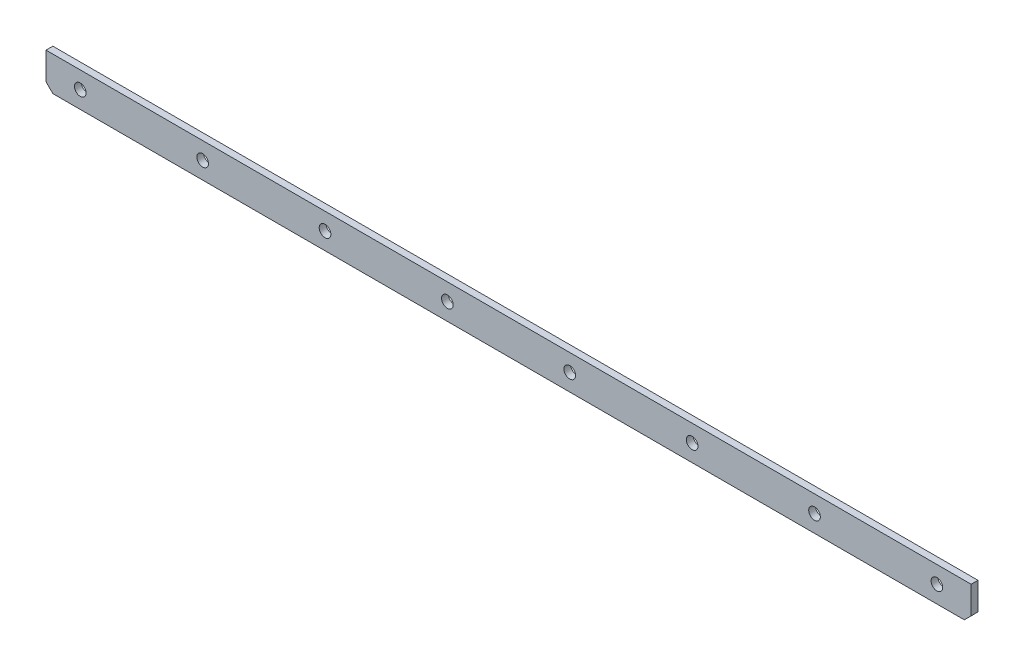
ISO-10303-21;
HEADER;
FILE_DESCRIPTION(('STEP AP214'),'2;1');
FILE_NAME('part.step','',(''),(''),'','','');
FILE_SCHEMA(('AUTOMOTIVE_DESIGN { 1 0 10303 214 1 1 1 1 }'));
ENDSEC;
DATA;
#1=APPLICATION_CONTEXT('core data for automotive mechanical design processes');
#2=APPLICATION_PROTOCOL_DEFINITION('international standard','automotive_design',2000,#1);
#3=PRODUCT_CONTEXT('',#1,'mechanical');
#4=PRODUCT('Part','Part','',(#3));
#5=PRODUCT_RELATED_PRODUCT_CATEGORY('part','',(#4));
#6=PRODUCT_DEFINITION_FORMATION('','',#4);
#7=PRODUCT_DEFINITION_CONTEXT('part definition',#1,'design');
#8=PRODUCT_DEFINITION('design','',#6,#7);
#9=PRODUCT_DEFINITION_SHAPE('','',#8);
#10=(LENGTH_UNIT() NAMED_UNIT(*) SI_UNIT(.MILLI.,.METRE.));
#11=(NAMED_UNIT(*) PLANE_ANGLE_UNIT() SI_UNIT($,.RADIAN.));
#12=(NAMED_UNIT(*) SI_UNIT($,.STERADIAN.) SOLID_ANGLE_UNIT());
#13=UNCERTAINTY_MEASURE_WITH_UNIT(LENGTH_MEASURE(1.E-05),#10,'distance_accuracy_value','');
#14=(GEOMETRIC_REPRESENTATION_CONTEXT(3) GLOBAL_UNCERTAINTY_ASSIGNED_CONTEXT((#13)) GLOBAL_UNIT_ASSIGNED_CONTEXT((#10,
#11,#12)) REPRESENTATION_CONTEXT('',''));
#15=CARTESIAN_POINT('',(0.,0.,0.));
#16=DIRECTION('',(0.,0.,1.));
#17=DIRECTION('',(1.,0.,0.));
#18=AXIS2_PLACEMENT_3D('',#15,#16,#17);
#19=CARTESIAN_POINT('',(-125.,0.,2.));
#20=DIRECTION('',(0.,0.,1.));
#21=DIRECTION('',(1.,0.,0.));
#22=AXIS2_PLACEMENT_3D('',#19,#20,#21);
#23=CYLINDRICAL_SURFACE('',#22,1.70000000000001);
#24=CARTESIAN_POINT('',(-125.,0.,0.));
#25=DIRECTION('',(0.,0.,1.));
#26=DIRECTION('',(1.,0.,0.));
#27=AXIS2_PLACEMENT_3D('',#24,#25,#26);
#28=CIRCLE('',#27,1.70000000000001);
#29=CARTESIAN_POINT('',(-123.3,0.,0.));
#30=VERTEX_POINT('',#29);
#31=EDGE_CURVE('E43',#30,#30,#28,.T.);
#32=ORIENTED_EDGE('',*,*,#31,.F.);
#33=EDGE_LOOP('',(#32));
#34=FACE_BOUND('',#33,.T.);
#35=CARTESIAN_POINT('',(-125.,0.,2.));
#36=DIRECTION('',(0.,0.,1.));
#37=DIRECTION('',(1.,0.,0.));
#38=AXIS2_PLACEMENT_3D('',#35,#36,#37);
#39=CIRCLE('',#38,1.70000000000001);
#40=CARTESIAN_POINT('',(-123.3,0.,2.));
#41=VERTEX_POINT('',#40);
#42=EDGE_CURVE('E11',#41,#41,#39,.T.);
#43=ORIENTED_EDGE('',*,*,#42,.T.);
#44=EDGE_LOOP('',(#43));
#45=FACE_BOUND('',#44,.T.);
#46=ADVANCED_FACE('F36',(#34,#45),#23,.F.);
#47=CARTESIAN_POINT('',(-89.2857142857143,0.,2.));
#48=DIRECTION('',(0.,0.,1.));
#49=DIRECTION('',(1.,0.,0.));
#50=AXIS2_PLACEMENT_3D('',#47,#48,#49);
#51=CYLINDRICAL_SURFACE('',#50,1.70000000000001);
#52=CARTESIAN_POINT('',(-89.2857142857143,0.,0.));
#53=DIRECTION('',(0.,0.,1.));
#54=DIRECTION('',(1.,0.,0.));
#55=AXIS2_PLACEMENT_3D('',#52,#53,#54);
#56=CIRCLE('',#55,1.70000000000001);
#57=CARTESIAN_POINT('',(-87.5857142857143,0.,0.));
#58=VERTEX_POINT('',#57);
#59=EDGE_CURVE('E164',#58,#58,#56,.T.);
#60=ORIENTED_EDGE('',*,*,#59,.F.);
#61=EDGE_LOOP('',(#60));
#62=FACE_BOUND('',#61,.T.);
#63=CARTESIAN_POINT('',(-89.2857142857143,0.,2.));
#64=DIRECTION('',(0.,0.,1.));
#65=DIRECTION('',(1.,0.,0.));
#66=AXIS2_PLACEMENT_3D('',#63,#64,#65);
#67=CIRCLE('',#66,1.70000000000001);
#68=CARTESIAN_POINT('',(-87.5857142857143,0.,2.));
#69=VERTEX_POINT('',#68);
#70=EDGE_CURVE('E167',#69,#69,#67,.T.);
#71=ORIENTED_EDGE('',*,*,#70,.T.);
#72=EDGE_LOOP('',(#71));
#73=FACE_BOUND('',#72,.T.);
#74=ADVANCED_FACE('F176',(#62,#73),#51,.F.);
#75=CARTESIAN_POINT('',(-53.5714285714286,0.,2.));
#76=DIRECTION('',(0.,0.,1.));
#77=DIRECTION('',(1.,0.,0.));
#78=AXIS2_PLACEMENT_3D('',#75,#76,#77);
#79=CYLINDRICAL_SURFACE('',#78,1.70000000000001);
#80=CARTESIAN_POINT('',(-53.5714285714286,0.,0.));
#81=DIRECTION('',(0.,0.,1.));
#82=DIRECTION('',(1.,0.,0.));
#83=AXIS2_PLACEMENT_3D('',#80,#81,#82);
#84=CIRCLE('',#83,1.70000000000001);
#85=CARTESIAN_POINT('',(-51.8714285714286,0.,0.));
#86=VERTEX_POINT('',#85);
#87=EDGE_CURVE('E158',#86,#86,#84,.T.);
#88=ORIENTED_EDGE('',*,*,#87,.F.);
#89=EDGE_LOOP('',(#88));
#90=FACE_BOUND('',#89,.T.);
#91=CARTESIAN_POINT('',(-53.5714285714286,0.,2.));
#92=DIRECTION('',(0.,0.,1.));
#93=DIRECTION('',(1.,0.,0.));
#94=AXIS2_PLACEMENT_3D('',#91,#92,#93);
#95=CIRCLE('',#94,1.70000000000001);
#96=CARTESIAN_POINT('',(-51.8714285714286,0.,2.));
#97=VERTEX_POINT('',#96);
#98=EDGE_CURVE('E161',#97,#97,#95,.T.);
#99=ORIENTED_EDGE('',*,*,#98,.T.);
#100=EDGE_LOOP('',(#99));
#101=FACE_BOUND('',#100,.T.);
#102=ADVANCED_FACE('F229',(#90,#101),#79,.F.);
#103=CARTESIAN_POINT('',(-17.8571428571429,0.,2.));
#104=DIRECTION('',(0.,0.,1.));
#105=DIRECTION('',(1.,0.,0.));
#106=AXIS2_PLACEMENT_3D('',#103,#104,#105);
#107=CYLINDRICAL_SURFACE('',#106,1.70000000000001);
#108=CARTESIAN_POINT('',(-17.8571428571429,0.,0.));
#109=DIRECTION('',(0.,0.,1.));
#110=DIRECTION('',(1.,0.,0.));
#111=AXIS2_PLACEMENT_3D('',#108,#109,#110);
#112=CIRCLE('',#111,1.70000000000001);
#113=CARTESIAN_POINT('',(-16.1571428571429,0.,0.));
#114=VERTEX_POINT('',#113);
#115=EDGE_CURVE('E152',#114,#114,#112,.T.);
#116=ORIENTED_EDGE('',*,*,#115,.F.);
#117=EDGE_LOOP('',(#116));
#118=FACE_BOUND('',#117,.T.);
#119=CARTESIAN_POINT('',(-17.8571428571429,0.,2.));
#120=DIRECTION('',(0.,0.,1.));
#121=DIRECTION('',(1.,0.,0.));
#122=AXIS2_PLACEMENT_3D('',#119,#120,#121);
#123=CIRCLE('',#122,1.70000000000001);
#124=CARTESIAN_POINT('',(-16.1571428571429,0.,2.));
#125=VERTEX_POINT('',#124);
#126=EDGE_CURVE('E155',#125,#125,#123,.T.);
#127=ORIENTED_EDGE('',*,*,#126,.T.);
#128=EDGE_LOOP('',(#127));
#129=FACE_BOUND('',#128,.T.);
#130=ADVANCED_FACE('F225',(#118,#129),#107,.F.);
#131=CARTESIAN_POINT('',(17.8571428571428,0.,2.));
#132=DIRECTION('',(0.,0.,1.));
#133=DIRECTION('',(1.,0.,0.));
#134=AXIS2_PLACEMENT_3D('',#131,#132,#133);
#135=CYLINDRICAL_SURFACE('',#134,1.70000000000001);
#136=CARTESIAN_POINT('',(17.8571428571428,0.,0.));
#137=DIRECTION('',(0.,0.,1.));
#138=DIRECTION('',(1.,0.,0.));
#139=AXIS2_PLACEMENT_3D('',#136,#137,#138);
#140=CIRCLE('',#139,1.70000000000001);
#141=CARTESIAN_POINT('',(19.5571428571428,0.,0.));
#142=VERTEX_POINT('',#141);
#143=EDGE_CURVE('E146',#142,#142,#140,.T.);
#144=ORIENTED_EDGE('',*,*,#143,.F.);
#145=EDGE_LOOP('',(#144));
#146=FACE_BOUND('',#145,.T.);
#147=CARTESIAN_POINT('',(17.8571428571428,0.,2.));
#148=DIRECTION('',(0.,0.,1.));
#149=DIRECTION('',(1.,0.,0.));
#150=AXIS2_PLACEMENT_3D('',#147,#148,#149);
#151=CIRCLE('',#150,1.70000000000001);
#152=CARTESIAN_POINT('',(19.5571428571428,0.,2.));
#153=VERTEX_POINT('',#152);
#154=EDGE_CURVE('E149',#153,#153,#151,.T.);
#155=ORIENTED_EDGE('',*,*,#154,.T.);
#156=EDGE_LOOP('',(#155));
#157=FACE_BOUND('',#156,.T.);
#158=ADVANCED_FACE('F221',(#146,#157),#135,.F.);
#159=CARTESIAN_POINT('',(53.5714285714285,0.,2.));
#160=DIRECTION('',(0.,0.,1.));
#161=DIRECTION('',(1.,0.,0.));
#162=AXIS2_PLACEMENT_3D('',#159,#160,#161);
#163=CYLINDRICAL_SURFACE('',#162,1.70000000000001);
#164=CARTESIAN_POINT('',(53.5714285714285,0.,0.));
#165=DIRECTION('',(0.,0.,1.));
#166=DIRECTION('',(1.,0.,0.));
#167=AXIS2_PLACEMENT_3D('',#164,#165,#166);
#168=CIRCLE('',#167,1.70000000000001);
#169=CARTESIAN_POINT('',(55.2714285714285,0.,0.));
#170=VERTEX_POINT('',#169);
#171=EDGE_CURVE('E140',#170,#170,#168,.T.);
#172=ORIENTED_EDGE('',*,*,#171,.F.);
#173=EDGE_LOOP('',(#172));
#174=FACE_BOUND('',#173,.T.);
#175=CARTESIAN_POINT('',(53.5714285714285,0.,2.));
#176=DIRECTION('',(0.,0.,1.));
#177=DIRECTION('',(1.,0.,0.));
#178=AXIS2_PLACEMENT_3D('',#175,#176,#177);
#179=CIRCLE('',#178,1.70000000000001);
#180=CARTESIAN_POINT('',(55.2714285714285,0.,2.));
#181=VERTEX_POINT('',#180);
#182=EDGE_CURVE('E143',#181,#181,#179,.T.);
#183=ORIENTED_EDGE('',*,*,#182,.T.);
#184=EDGE_LOOP('',(#183));
#185=FACE_BOUND('',#184,.T.);
#186=ADVANCED_FACE('F205',(#174,#185),#163,.F.);
#187=CARTESIAN_POINT('',(-135.,-5.00000000000002,2.));
#188=DIRECTION('',(1.,0.,0.));
#189=DIRECTION('',(0.,0.,-1.));
#190=AXIS2_PLACEMENT_3D('',#187,#188,#189);
#191=PLANE('',#190);
#192=DIRECTION('',(0.,-1.,0.));
#193=VECTOR('',#192,1.);
#194=CARTESIAN_POINT('',(-135.,-5.00000000000002,0.));
#195=LINE('',#194,#193);
#196=CARTESIAN_POINT('',(-135.,4.99999999999998,0.));
#197=VERTEX_POINT('',#196);
#198=CARTESIAN_POINT('',(-135.,-3.00000000000002,0.));
#199=VERTEX_POINT('',#198);
#200=EDGE_CURVE('E116',#197,#199,#195,.T.);
#201=ORIENTED_EDGE('',*,*,#200,.T.);
#202=DIRECTION('',(0.,0.,1.));
#203=VECTOR('',#202,1.);
#204=CARTESIAN_POINT('',(-135.,-3.00000000000002,2.));
#205=LINE('',#204,#203);
#206=CARTESIAN_POINT('',(-135.,-3.00000000000002,2.));
#207=VERTEX_POINT('',#206);
#208=EDGE_CURVE('E58',#199,#207,#205,.T.);
#209=ORIENTED_EDGE('',*,*,#208,.T.);
#210=DIRECTION('',(0.,-1.,0.));
#211=VECTOR('',#210,1.);
#212=CARTESIAN_POINT('',(-135.,-5.00000000000002,2.));
#213=LINE('',#212,#211);
#214=CARTESIAN_POINT('',(-135.,4.99999999999998,2.));
#215=VERTEX_POINT('',#214);
#216=EDGE_CURVE('E124',#215,#207,#213,.T.);
#217=ORIENTED_EDGE('',*,*,#216,.F.);
#218=DIRECTION('',(0.,0.,-1.));
#219=VECTOR('',#218,1.);
#220=CARTESIAN_POINT('',(-135.,4.99999999999998,2.));
#221=LINE('',#220,#219);
#222=EDGE_CURVE('E108',#215,#197,#221,.T.);
#223=ORIENTED_EDGE('',*,*,#222,.T.);
#224=EDGE_LOOP('',(#201,#209,#217,#223));
#225=FACE_BOUND('',#224,.T.);
#226=ADVANCED_FACE('F201',(#225),#191,.F.);
#227=CARTESIAN_POINT('',(135.,-4.99999999999998,2.));
#228=DIRECTION('',(0.,1.,0.));
#229=DIRECTION('',(-1.,0.,0.));
#230=AXIS2_PLACEMENT_3D('',#227,#228,#229);
#231=PLANE('',#230);
#232=DIRECTION('',(1.,0.,0.));
#233=VECTOR('',#232,1.);
#234=CARTESIAN_POINT('',(135.,-4.99999999999998,2.));
#235=LINE('',#234,#233);
#236=CARTESIAN_POINT('',(-133.,-5.00000000000002,2.));
#237=VERTEX_POINT('',#236);
#238=CARTESIAN_POINT('',(133.,-4.99999999999998,2.));
#239=VERTEX_POINT('',#238);
#240=EDGE_CURVE('E98',#237,#239,#235,.T.);
#241=ORIENTED_EDGE('',*,*,#240,.F.);
#242=DIRECTION('',(0.,0.,-1.));
#243=VECTOR('',#242,1.);
#244=CARTESIAN_POINT('',(-133.,-5.00000000000002,2.));
#245=LINE('',#244,#243);
#246=CARTESIAN_POINT('',(-133.,-5.00000000000002,0.));
#247=VERTEX_POINT('',#246);
#248=EDGE_CURVE('E127',#237,#247,#245,.T.);
#249=ORIENTED_EDGE('',*,*,#248,.T.);
#250=DIRECTION('',(1.,0.,0.));
#251=VECTOR('',#250,1.);
#252=CARTESIAN_POINT('',(135.,-4.99999999999998,0.));
#253=LINE('',#252,#251);
#254=CARTESIAN_POINT('',(133.,-4.99999999999998,0.));
#255=VERTEX_POINT('',#254);
#256=EDGE_CURVE('E118',#247,#255,#253,.T.);
#257=ORIENTED_EDGE('',*,*,#256,.T.);
#258=DIRECTION('',(0.,0.,1.));
#259=VECTOR('',#258,1.);
#260=CARTESIAN_POINT('',(133.,-4.99999999999998,2.));
#261=LINE('',#260,#259);
#262=EDGE_CURVE('E107',#255,#239,#261,.T.);
#263=ORIENTED_EDGE('',*,*,#262,.T.);
#264=EDGE_LOOP('',(#241,#249,#257,#263));
#265=FACE_BOUND('',#264,.T.);
#266=ADVANCED_FACE('F198',(#265),#231,.F.);
#267=CARTESIAN_POINT('',(135.,-4.99999999999998,2.));
#268=DIRECTION('',(-1.,0.,0.));
#269=DIRECTION('',(0.,0.,1.));
#270=AXIS2_PLACEMENT_3D('',#267,#268,#269);
#271=PLANE('',#270);
#272=DIRECTION('',(0.,1.,0.));
#273=VECTOR('',#272,1.);
#274=CARTESIAN_POINT('',(135.,-4.99999999999998,2.));
#275=LINE('',#274,#273);
#276=CARTESIAN_POINT('',(135.,-2.99999999999998,2.));
#277=VERTEX_POINT('',#276);
#278=CARTESIAN_POINT('',(135.,5.00000000000002,2.));
#279=VERTEX_POINT('',#278);
#280=EDGE_CURVE('E88',#277,#279,#275,.T.);
#281=ORIENTED_EDGE('',*,*,#280,.F.);
#282=DIRECTION('',(0.,0.,-1.));
#283=VECTOR('',#282,1.);
#284=CARTESIAN_POINT('',(135.,-2.99999999999998,2.));
#285=LINE('',#284,#283);
#286=CARTESIAN_POINT('',(135.,-2.99999999999998,0.));
#287=VERTEX_POINT('',#286);
#288=EDGE_CURVE('E138',#277,#287,#285,.T.);
#289=ORIENTED_EDGE('',*,*,#288,.T.);
#290=DIRECTION('',(0.,1.,0.));
#291=VECTOR('',#290,1.);
#292=CARTESIAN_POINT('',(135.,-4.99999999999998,0.));
#293=LINE('',#292,#291);
#294=CARTESIAN_POINT('',(135.,5.00000000000002,0.));
#295=VERTEX_POINT('',#294);
#296=EDGE_CURVE('E104',#287,#295,#293,.T.);
#297=ORIENTED_EDGE('',*,*,#296,.T.);
#298=DIRECTION('',(0.,0.,-1.));
#299=VECTOR('',#298,1.);
#300=CARTESIAN_POINT('',(135.,5.00000000000002,2.));
#301=LINE('',#300,#299);
#302=EDGE_CURVE('E101',#279,#295,#301,.T.);
#303=ORIENTED_EDGE('',*,*,#302,.F.);
#304=EDGE_LOOP('',(#281,#289,#297,#303));
#305=FACE_BOUND('',#304,.T.);
#306=ADVANCED_FACE('F102',(#305),#271,.F.);
#307=CARTESIAN_POINT('',(135.,5.00000000000002,2.));
#308=DIRECTION('',(0.,-1.,0.));
#309=DIRECTION('',(1.,0.,0.));
#310=AXIS2_PLACEMENT_3D('',#307,#308,#309);
#311=PLANE('',#310);
#312=DIRECTION('',(-1.,0.,0.));
#313=VECTOR('',#312,1.);
#314=CARTESIAN_POINT('',(135.,5.00000000000002,0.));
#315=LINE('',#314,#313);
#316=EDGE_CURVE('E123',#295,#197,#315,.T.);
#317=ORIENTED_EDGE('',*,*,#316,.T.);
#318=ORIENTED_EDGE('',*,*,#222,.F.);
#319=DIRECTION('',(-1.,0.,0.));
#320=VECTOR('',#319,1.);
#321=CARTESIAN_POINT('',(135.,5.00000000000002,2.));
#322=LINE('',#321,#320);
#323=EDGE_CURVE('E93',#279,#215,#322,.T.);
#324=ORIENTED_EDGE('',*,*,#323,.F.);
#325=ORIENTED_EDGE('',*,*,#302,.T.);
#326=EDGE_LOOP('',(#317,#318,#324,#325));
#327=FACE_BOUND('',#326,.T.);
#328=ADVANCED_FACE('F110',(#327),#311,.F.);
#329=CARTESIAN_POINT('',(0.,0.,2.));
#330=DIRECTION('',(0.,0.,1.));
#331=DIRECTION('',(1.,0.,0.));
#332=AXIS2_PLACEMENT_3D('',#329,#330,#331);
#333=PLANE('',#332);
#334=CARTESIAN_POINT('',(89.2857142857142,0.,2.));
#335=DIRECTION('',(0.,0.,1.));
#336=DIRECTION('',(1.,0.,0.));
#337=AXIS2_PLACEMENT_3D('',#334,#335,#336);
#338=CIRCLE('',#337,1.70000000000001);
#339=CARTESIAN_POINT('',(90.9857142857142,0.,2.));
#340=VERTEX_POINT('',#339);
#341=EDGE_CURVE('E340',#340,#340,#338,.T.);
#342=ORIENTED_EDGE('',*,*,#341,.F.);
#343=EDGE_LOOP('',(#342));
#344=FACE_BOUND('',#343,.T.);
#345=CARTESIAN_POINT('',(125.,0.,2.));
#346=DIRECTION('',(0.,0.,1.));
#347=DIRECTION('',(1.,0.,0.));
#348=AXIS2_PLACEMENT_3D('',#345,#346,#347);
#349=CIRCLE('',#348,1.70000000000001);
#350=CARTESIAN_POINT('',(126.7,0.,2.));
#351=VERTEX_POINT('',#350);
#352=EDGE_CURVE('E341',#351,#351,#349,.T.);
#353=ORIENTED_EDGE('',*,*,#352,.F.);
#354=EDGE_LOOP('',(#353));
#355=FACE_BOUND('',#354,.T.);
#356=ORIENTED_EDGE('',*,*,#216,.T.);
#357=DIRECTION('',(-0.707106781186547,0.707106781186548,0.));
#358=VECTOR('',#357,1.);
#359=CARTESIAN_POINT('',(-69.0000000000001,-69.,2.));
#360=LINE('',#359,#358);
#361=EDGE_CURVE('E136',#207,#237,#360,.F.);
#362=ORIENTED_EDGE('',*,*,#361,.T.);
#363=ORIENTED_EDGE('',*,*,#240,.T.);
#364=DIRECTION('',(-0.707106781186548,-0.707106781186547,0.));
#365=VECTOR('',#364,1.);
#366=CARTESIAN_POINT('',(68.9999999999999,-69.,2.));
#367=LINE('',#366,#365);
#368=EDGE_CURVE('E50',#239,#277,#367,.F.);
#369=ORIENTED_EDGE('',*,*,#368,.T.);
#370=ORIENTED_EDGE('',*,*,#280,.T.);
#371=ORIENTED_EDGE('',*,*,#323,.T.);
#372=EDGE_LOOP('',(#356,#362,#363,#369,#370,#371));
#373=FACE_BOUND('',#372,.T.);
#374=ORIENTED_EDGE('',*,*,#182,.F.);
#375=EDGE_LOOP('',(#374));
#376=FACE_BOUND('',#375,.T.);
#377=ORIENTED_EDGE('',*,*,#154,.F.);
#378=EDGE_LOOP('',(#377));
#379=FACE_BOUND('',#378,.T.);
#380=ORIENTED_EDGE('',*,*,#126,.F.);
#381=EDGE_LOOP('',(#380));
#382=FACE_BOUND('',#381,.T.);
#383=ORIENTED_EDGE('',*,*,#98,.F.);
#384=EDGE_LOOP('',(#383));
#385=FACE_BOUND('',#384,.T.);
#386=ORIENTED_EDGE('',*,*,#70,.F.);
#387=EDGE_LOOP('',(#386));
#388=FACE_BOUND('',#387,.T.);
#389=ORIENTED_EDGE('',*,*,#42,.F.);
#390=EDGE_LOOP('',(#389));
#391=FACE_BOUND('',#390,.T.);
#392=ADVANCED_FACE('F90',(#344,#355,#373,#376,#379,#382,#385,#388,#391),#333,.T.);
#393=CARTESIAN_POINT('',(0.,0.,0.));
#394=DIRECTION('',(0.,0.,1.));
#395=DIRECTION('',(1.,0.,0.));
#396=AXIS2_PLACEMENT_3D('',#393,#394,#395);
#397=PLANE('',#396);
#398=CARTESIAN_POINT('',(89.2857142857142,0.,0.));
#399=DIRECTION('',(0.,0.,1.));
#400=DIRECTION('',(1.,0.,0.));
#401=AXIS2_PLACEMENT_3D('',#398,#399,#400);
#402=CIRCLE('',#401,1.70000000000001);
#403=CARTESIAN_POINT('',(90.9857142857142,0.,0.));
#404=VERTEX_POINT('',#403);
#405=EDGE_CURVE('E338',#404,#404,#402,.T.);
#406=ORIENTED_EDGE('',*,*,#405,.T.);
#407=EDGE_LOOP('',(#406));
#408=FACE_BOUND('',#407,.T.);
#409=CARTESIAN_POINT('',(125.,0.,0.));
#410=DIRECTION('',(0.,0.,1.));
#411=DIRECTION('',(1.,0.,0.));
#412=AXIS2_PLACEMENT_3D('',#409,#410,#411);
#413=CIRCLE('',#412,1.70000000000001);
#414=CARTESIAN_POINT('',(126.7,0.,0.));
#415=VERTEX_POINT('',#414);
#416=EDGE_CURVE('E119',#415,#415,#413,.T.);
#417=ORIENTED_EDGE('',*,*,#416,.T.);
#418=EDGE_LOOP('',(#417));
#419=FACE_BOUND('',#418,.T.);
#420=ORIENTED_EDGE('',*,*,#256,.F.);
#421=DIRECTION('',(0.707106781186547,-0.707106781186548,0.));
#422=VECTOR('',#421,1.);
#423=CARTESIAN_POINT('',(-133.,-5.00000000000002,0.));
#424=LINE('',#423,#422);
#425=EDGE_CURVE('E132',#247,#199,#424,.F.);
#426=ORIENTED_EDGE('',*,*,#425,.T.);
#427=ORIENTED_EDGE('',*,*,#200,.F.);
#428=ORIENTED_EDGE('',*,*,#316,.F.);
#429=ORIENTED_EDGE('',*,*,#296,.F.);
#430=DIRECTION('',(0.707106781186548,0.707106781186547,0.));
#431=VECTOR('',#430,1.);
#432=CARTESIAN_POINT('',(135.,-2.99999999999998,0.));
#433=LINE('',#432,#431);
#434=EDGE_CURVE('E130',#287,#255,#433,.F.);
#435=ORIENTED_EDGE('',*,*,#434,.T.);
#436=EDGE_LOOP('',(#420,#426,#427,#428,#429,#435));
#437=FACE_BOUND('',#436,.T.);
#438=ORIENTED_EDGE('',*,*,#171,.T.);
#439=EDGE_LOOP('',(#438));
#440=FACE_BOUND('',#439,.T.);
#441=ORIENTED_EDGE('',*,*,#143,.T.);
#442=EDGE_LOOP('',(#441));
#443=FACE_BOUND('',#442,.T.);
#444=ORIENTED_EDGE('',*,*,#115,.T.);
#445=EDGE_LOOP('',(#444));
#446=FACE_BOUND('',#445,.T.);
#447=ORIENTED_EDGE('',*,*,#87,.T.);
#448=EDGE_LOOP('',(#447));
#449=FACE_BOUND('',#448,.T.);
#450=ORIENTED_EDGE('',*,*,#59,.T.);
#451=EDGE_LOOP('',(#450));
#452=FACE_BOUND('',#451,.T.);
#453=ORIENTED_EDGE('',*,*,#31,.T.);
#454=EDGE_LOOP('',(#453));
#455=FACE_BOUND('',#454,.T.);
#456=ADVANCED_FACE('F172',(#408,#419,#437,#440,#443,#446,#449,#452,#455),#397,.F.);
#457=CARTESIAN_POINT('',(-133.,-5.00000000000002,2.));
#458=DIRECTION('',(0.707106781186548,0.707106781186547,0.));
#459=DIRECTION('',(0.,0.,-1.));
#460=AXIS2_PLACEMENT_3D('',#457,#458,#459);
#461=PLANE('',#460);
#462=ORIENTED_EDGE('',*,*,#361,.F.);
#463=ORIENTED_EDGE('',*,*,#208,.F.);
#464=ORIENTED_EDGE('',*,*,#425,.F.);
#465=ORIENTED_EDGE('',*,*,#248,.F.);
#466=EDGE_LOOP('',(#462,#463,#464,#465));
#467=FACE_BOUND('',#466,.T.);
#468=ADVANCED_FACE('F186',(#467),#461,.F.);
#469=CARTESIAN_POINT('',(135.,-2.99999999999998,2.));
#470=DIRECTION('',(-0.707106781186547,0.707106781186548,0.));
#471=DIRECTION('',(0.,0.,-1.));
#472=AXIS2_PLACEMENT_3D('',#469,#470,#471);
#473=PLANE('',#472);
#474=ORIENTED_EDGE('',*,*,#368,.F.);
#475=ORIENTED_EDGE('',*,*,#262,.F.);
#476=ORIENTED_EDGE('',*,*,#434,.F.);
#477=ORIENTED_EDGE('',*,*,#288,.F.);
#478=EDGE_LOOP('',(#474,#475,#476,#477));
#479=FACE_BOUND('',#478,.T.);
#480=ADVANCED_FACE('F212',(#479),#473,.F.);
#481=CARTESIAN_POINT('',(125.,0.,2.));
#482=DIRECTION('',(0.,0.,1.));
#483=DIRECTION('',(1.,0.,0.));
#484=AXIS2_PLACEMENT_3D('',#481,#482,#483);
#485=CYLINDRICAL_SURFACE('',#484,1.70000000000001);
#486=ORIENTED_EDGE('',*,*,#416,.F.);
#487=EDGE_LOOP('',(#486));
#488=FACE_BOUND('',#487,.T.);
#489=ORIENTED_EDGE('',*,*,#352,.T.);
#490=EDGE_LOOP('',(#489));
#491=FACE_BOUND('',#490,.T.);
#492=ADVANCED_FACE('F193',(#488,#491),#485,.F.);
#493=CARTESIAN_POINT('',(89.2857142857142,0.,2.));
#494=DIRECTION('',(0.,0.,1.));
#495=DIRECTION('',(1.,0.,0.));
#496=AXIS2_PLACEMENT_3D('',#493,#494,#495);
#497=CYLINDRICAL_SURFACE('',#496,1.70000000000001);
#498=ORIENTED_EDGE('',*,*,#405,.F.);
#499=EDGE_LOOP('',(#498));
#500=FACE_BOUND('',#499,.T.);
#501=ORIENTED_EDGE('',*,*,#341,.T.);
#502=EDGE_LOOP('',(#501));
#503=FACE_BOUND('',#502,.T.);
#504=ADVANCED_FACE('F308',(#500,#503),#497,.F.);
#505=CLOSED_SHELL('',(#46,#74,#102,#130,#158,#186,#226,#266,#306,#328,#392,#456,#468,#480,#492,#504));
#506=MANIFOLD_SOLID_BREP('B2',#505);
#507=ADVANCED_BREP_SHAPE_REPRESENTATION('',(#18,#506),#14);
#508=SHAPE_DEFINITION_REPRESENTATION(#9,#507);
ENDSEC;
END-ISO-10303-21;
